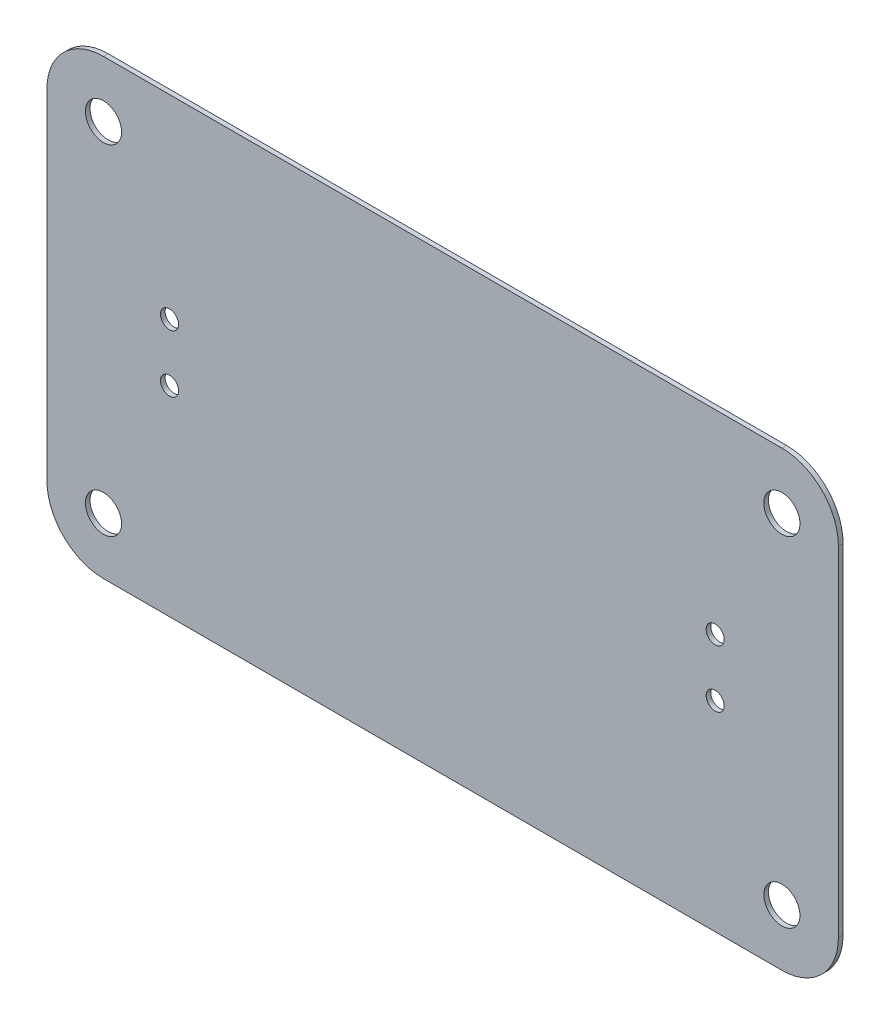
ISO-10303-21;
HEADER;
FILE_DESCRIPTION(('STEP AP214'),'2;1');
FILE_NAME('part.step','',(''),(''),'','','');
FILE_SCHEMA(('AUTOMOTIVE_DESIGN { 1 0 10303 214 1 1 1 1 }'));
ENDSEC;
DATA;
#1=APPLICATION_CONTEXT('core data for automotive mechanical design processes');
#2=APPLICATION_PROTOCOL_DEFINITION('international standard','automotive_design',2000,#1);
#3=PRODUCT_CONTEXT('',#1,'mechanical');
#4=PRODUCT('Part','Part','',(#3));
#5=PRODUCT_RELATED_PRODUCT_CATEGORY('part','',(#4));
#6=PRODUCT_DEFINITION_FORMATION('','',#4);
#7=PRODUCT_DEFINITION_CONTEXT('part definition',#1,'design');
#8=PRODUCT_DEFINITION('design','',#6,#7);
#9=PRODUCT_DEFINITION_SHAPE('','',#8);
#10=(LENGTH_UNIT() NAMED_UNIT(*) SI_UNIT(.MILLI.,.METRE.));
#11=(NAMED_UNIT(*) PLANE_ANGLE_UNIT() SI_UNIT($,.RADIAN.));
#12=(NAMED_UNIT(*) SI_UNIT($,.STERADIAN.) SOLID_ANGLE_UNIT());
#13=UNCERTAINTY_MEASURE_WITH_UNIT(LENGTH_MEASURE(1.E-05),#10,'distance_accuracy_value','');
#14=(GEOMETRIC_REPRESENTATION_CONTEXT(3) GLOBAL_UNCERTAINTY_ASSIGNED_CONTEXT((#13)) GLOBAL_UNIT_ASSIGNED_CONTEXT((#10,
#11,#12)) REPRESENTATION_CONTEXT('',''));
#15=CARTESIAN_POINT('',(0.,0.,0.));
#16=DIRECTION('',(0.,0.,1.));
#17=DIRECTION('',(1.,0.,0.));
#18=AXIS2_PLACEMENT_3D('',#15,#16,#17);
#19=CARTESIAN_POINT('',(35.386001586914,38.608001708984,0.41148));
#20=DIRECTION('',(0.,0.,1.));
#21=DIRECTION('',(1.,0.,0.));
#22=AXIS2_PLACEMENT_3D('',#19,#20,#21);
#23=PLANE('',#22);
#24=CARTESIAN_POINT('',(100.38599938,68.60800096,0.41148));
#25=DIRECTION('',(0.,0.,-1.));
#26=DIRECTION('',(-1.,0.,0.));
#27=AXIS2_PLACEMENT_3D('',#24,#25,#26);
#28=CIRCLE('',#27,1.59999934);
#29=CARTESIAN_POINT('',(98.78600004,68.60800096,0.41148));
#30=VERTEX_POINT('',#29);
#31=EDGE_CURVE('E148',#30,#30,#28,.T.);
#32=ORIENTED_EDGE('',*,*,#31,.T.);
#33=EDGE_LOOP('',(#32));
#34=FACE_BOUND('',#33,.T.);
#35=CARTESIAN_POINT('',(94.488,56.38800508,0.41148));
#36=DIRECTION('',(0.,0.,-1.));
#37=DIRECTION('',(-1.,0.,0.));
#38=AXIS2_PLACEMENT_3D('',#35,#36,#37);
#39=CIRCLE('',#38,0.7999984);
#40=CARTESIAN_POINT('',(93.6880016,56.38800508,0.41148));
#41=VERTEX_POINT('',#40);
#42=EDGE_CURVE('E151',#41,#41,#39,.T.);
#43=ORIENTED_EDGE('',*,*,#42,.T.);
#44=EDGE_LOOP('',(#43));
#45=FACE_BOUND('',#44,.T.);
#46=CARTESIAN_POINT('',(100.38599938,38.608,0.41148));
#47=DIRECTION('',(0.,0.,-1.));
#48=DIRECTION('',(-1.,0.,0.));
#49=AXIS2_PLACEMENT_3D('',#46,#47,#48);
#50=CIRCLE('',#49,1.59999934);
#51=CARTESIAN_POINT('',(98.78600004,38.608,0.41148));
#52=VERTEX_POINT('',#51);
#53=EDGE_CURVE('E154',#52,#52,#50,.T.);
#54=ORIENTED_EDGE('',*,*,#53,.T.);
#55=EDGE_LOOP('',(#54));
#56=FACE_BOUND('',#55,.T.);
#57=CARTESIAN_POINT('',(94.488,51.30799492,0.41148));
#58=DIRECTION('',(0.,0.,-1.));
#59=DIRECTION('',(-1.,0.,0.));
#60=AXIS2_PLACEMENT_3D('',#57,#58,#59);
#61=CIRCLE('',#60,0.7999984);
#62=CARTESIAN_POINT('',(93.6880016,51.30799492,0.41148));
#63=VERTEX_POINT('',#62);
#64=EDGE_CURVE('E157',#63,#63,#61,.T.);
#65=ORIENTED_EDGE('',*,*,#64,.T.);
#66=EDGE_LOOP('',(#65));
#67=FACE_BOUND('',#66,.T.);
#68=CARTESIAN_POINT('',(46.228,56.388,0.41148));
#69=DIRECTION('',(0.,0.,-1.));
#70=DIRECTION('',(-1.,0.,0.));
#71=AXIS2_PLACEMENT_3D('',#68,#69,#70);
#72=CIRCLE('',#71,0.7999984);
#73=CARTESIAN_POINT('',(45.4280016,56.388,0.41148));
#74=VERTEX_POINT('',#73);
#75=EDGE_CURVE('E160',#74,#74,#72,.T.);
#76=ORIENTED_EDGE('',*,*,#75,.T.);
#77=EDGE_LOOP('',(#76));
#78=FACE_BOUND('',#77,.T.);
#79=CARTESIAN_POINT('',(40.38599746,68.60800096,0.41148));
#80=DIRECTION('',(0.,0.,-1.));
#81=DIRECTION('',(-1.,0.,0.));
#82=AXIS2_PLACEMENT_3D('',#79,#80,#81);
#83=CIRCLE('',#82,1.59999934);
#84=CARTESIAN_POINT('',(38.78599812,68.60800096,0.41148));
#85=VERTEX_POINT('',#84);
#86=EDGE_CURVE('E163',#85,#85,#83,.T.);
#87=ORIENTED_EDGE('',*,*,#86,.T.);
#88=EDGE_LOOP('',(#87));
#89=FACE_BOUND('',#88,.T.);
#90=CARTESIAN_POINT('',(46.228,51.308,0.41148));
#91=DIRECTION('',(0.,0.,-1.));
#92=DIRECTION('',(-1.,0.,0.));
#93=AXIS2_PLACEMENT_3D('',#90,#91,#92);
#94=CIRCLE('',#93,0.7999984);
#95=CARTESIAN_POINT('',(45.4280016,51.308,0.41148));
#96=VERTEX_POINT('',#95);
#97=EDGE_CURVE('E166',#96,#96,#94,.T.);
#98=ORIENTED_EDGE('',*,*,#97,.T.);
#99=EDGE_LOOP('',(#98));
#100=FACE_BOUND('',#99,.T.);
#101=CARTESIAN_POINT('',(40.386,38.608,0.41148));
#102=DIRECTION('',(0.,0.,-1.));
#103=DIRECTION('',(-1.,0.,0.));
#104=AXIS2_PLACEMENT_3D('',#101,#102,#103);
#105=CIRCLE('',#104,1.59999934);
#106=CARTESIAN_POINT('',(38.78600066,38.608,0.41148));
#107=VERTEX_POINT('',#106);
#108=EDGE_CURVE('E169',#107,#107,#105,.T.);
#109=ORIENTED_EDGE('',*,*,#108,.T.);
#110=EDGE_LOOP('',(#109));
#111=FACE_BOUND('',#110,.T.);
#112=CARTESIAN_POINT('',(40.384413247929,68.60959004797,0.41148));
#113=DIRECTION('',(0.,0.,-1.));
#114=DIRECTION('',(-1.,0.,0.));
#115=AXIS2_PLACEMENT_3D('',#112,#113,#114);
#116=CIRCLE('',#115,4.998411913377);
#117=CARTESIAN_POINT('',(35.386001586914,68.608001708984,0.41148));
#118=VERTEX_POINT('',#117);
#119=CARTESIAN_POINT('',(40.386001586914,73.6080017089846,0.41148));
#120=VERTEX_POINT('',#119);
#121=EDGE_CURVE('E172',#118,#120,#116,.T.);
#122=ORIENTED_EDGE('',*,*,#121,.F.);
#123=DIRECTION('',(0.,1.,0.));
#124=VECTOR('',#123,1.);
#125=CARTESIAN_POINT('',(35.386001586914,38.608001708984,0.41148));
#126=LINE('',#125,#124);
#127=CARTESIAN_POINT('',(35.3860015869142,38.608001708984,0.41148));
#128=VERTEX_POINT('',#127);
#129=EDGE_CURVE('E93',#128,#118,#126,.T.);
#130=ORIENTED_EDGE('',*,*,#129,.F.);
#131=CARTESIAN_POINT('',(40.384400233771,38.606400355841,0.41148));
#132=DIRECTION('',(0.,0.,-1.));
#133=DIRECTION('',(-1.,0.,0.));
#134=AXIS2_PLACEMENT_3D('',#131,#132,#133);
#135=CIRCLE('',#134,4.998398903372);
#136=CARTESIAN_POINT('',(40.386001586914,33.608001708984,0.41148));
#137=VERTEX_POINT('',#136);
#138=EDGE_CURVE('E20',#137,#128,#135,.T.);
#139=ORIENTED_EDGE('',*,*,#138,.F.);
#140=DIRECTION('',(1.,0.,0.));
#141=VECTOR('',#140,1.);
#142=CARTESIAN_POINT('',(100.38600158691,33.608001708984,0.41148));
#143=LINE('',#142,#141);
#144=CARTESIAN_POINT('',(100.38600158691,33.6080017089842,0.41148));
#145=VERTEX_POINT('',#144);
#146=EDGE_CURVE('E79',#145,#137,#143,.F.);
#147=ORIENTED_EDGE('',*,*,#146,.F.);
#148=CARTESIAN_POINT('',(100.38758992589,38.606413369999,0.41148));
#149=DIRECTION('',(0.,0.,-1.));
#150=DIRECTION('',(-1.,0.,0.));
#151=AXIS2_PLACEMENT_3D('',#148,#149,#150);
#152=CIRCLE('',#151,4.998411913377);
#153=CARTESIAN_POINT('',(105.38600158691,38.608001708984,0.41148));
#154=VERTEX_POINT('',#153);
#155=EDGE_CURVE('E100',#154,#145,#152,.T.);
#156=ORIENTED_EDGE('',*,*,#155,.F.);
#157=DIRECTION('',(0.,1.,0.));
#158=VECTOR('',#157,1.);
#159=CARTESIAN_POINT('',(105.38600158691,68.608001708984,0.41148));
#160=LINE('',#159,#158);
#161=CARTESIAN_POINT('',(105.386001586909,68.608001708984,0.41148));
#162=VERTEX_POINT('',#161);
#163=EDGE_CURVE('E111',#162,#154,#160,.F.);
#164=ORIENTED_EDGE('',*,*,#163,.F.);
#165=CARTESIAN_POINT('',(100.38757691164,68.609577033716,0.41148));
#166=DIRECTION('',(0.,0.,-1.));
#167=DIRECTION('',(-1.,0.,0.));
#168=AXIS2_PLACEMENT_3D('',#165,#166,#167);
#169=CIRCLE('',#168,4.998424923511);
#170=CARTESIAN_POINT('',(100.38600158691,73.608001708984,0.41148));
#171=VERTEX_POINT('',#170);
#172=EDGE_CURVE('E175',#171,#162,#169,.T.);
#173=ORIENTED_EDGE('',*,*,#172,.F.);
#174=DIRECTION('',(1.,0.,0.));
#175=VECTOR('',#174,1.);
#176=CARTESIAN_POINT('',(40.386001586914,73.608001708984,0.41148));
#177=LINE('',#176,#175);
#178=EDGE_CURVE('E107',#120,#171,#177,.T.);
#179=ORIENTED_EDGE('',*,*,#178,.F.);
#180=EDGE_LOOP('',(#122,#130,#139,#147,#156,#164,#173,#179));
#181=FACE_BOUND('',#180,.T.);
#182=ADVANCED_FACE('F17',(#34,#45,#56,#67,#78,#89,#100,#111,#181),#23,.T.);
#183=CARTESIAN_POINT('',(40.384400233771,38.606400355841,0.));
#184=DIRECTION('',(0.,0.,-1.));
#185=DIRECTION('',(-1.,0.,0.));
#186=AXIS2_PLACEMENT_3D('',#183,#184,#185);
#187=CYLINDRICAL_SURFACE('',#186,4.998398903372);
#188=DIRECTION('',(0.,0.,1.));
#189=VECTOR('',#188,1.);
#190=CARTESIAN_POINT('',(35.386001586914,38.608001708984,0.));
#191=LINE('',#190,#189);
#192=CARTESIAN_POINT('',(35.3860015869142,38.608001708984,0.));
#193=VERTEX_POINT('',#192);
#194=EDGE_CURVE('E106',#193,#128,#191,.T.);
#195=ORIENTED_EDGE('',*,*,#194,.F.);
#196=CARTESIAN_POINT('',(40.384400233771,38.606400355841,0.));
#197=DIRECTION('',(0.,0.,-1.));
#198=DIRECTION('',(-1.,0.,0.));
#199=AXIS2_PLACEMENT_3D('',#196,#197,#198);
#200=CIRCLE('',#199,4.998398903372);
#201=CARTESIAN_POINT('',(40.386001586914,33.608001708984,0.));
#202=VERTEX_POINT('',#201);
#203=EDGE_CURVE('E99',#193,#202,#200,.F.);
#204=ORIENTED_EDGE('',*,*,#203,.T.);
#205=DIRECTION('',(0.,0.,-1.));
#206=VECTOR('',#205,1.);
#207=CARTESIAN_POINT('',(40.386001586914,33.608001708984,0.));
#208=LINE('',#207,#206);
#209=EDGE_CURVE('E84',#137,#202,#208,.T.);
#210=ORIENTED_EDGE('',*,*,#209,.F.);
#211=ORIENTED_EDGE('',*,*,#138,.T.);
#212=EDGE_LOOP('',(#195,#204,#210,#211));
#213=FACE_BOUND('',#212,.T.);
#214=ADVANCED_FACE('F98',(#213),#187,.T.);
#215=CARTESIAN_POINT('',(100.38600158691,33.608001708984,0.));
#216=DIRECTION('',(0.,-1.,0.));
#217=DIRECTION('',(0.,0.,-1.));
#218=AXIS2_PLACEMENT_3D('',#215,#216,#217);
#219=PLANE('',#218);
#220=ORIENTED_EDGE('',*,*,#209,.T.);
#221=DIRECTION('',(1.,0.,0.));
#222=VECTOR('',#221,1.);
#223=CARTESIAN_POINT('',(35.386001586914,33.608001708984,0.));
#224=LINE('',#223,#222);
#225=CARTESIAN_POINT('',(100.38600158691,33.6080017089842,0.));
#226=VERTEX_POINT('',#225);
#227=EDGE_CURVE('E146',#202,#226,#224,.T.);
#228=ORIENTED_EDGE('',*,*,#227,.T.);
#229=DIRECTION('',(0.,0.,-1.));
#230=VECTOR('',#229,1.);
#231=CARTESIAN_POINT('',(100.38600158691,33.6080017089842,0.));
#232=LINE('',#231,#230);
#233=EDGE_CURVE('E86',#145,#226,#232,.T.);
#234=ORIENTED_EDGE('',*,*,#233,.F.);
#235=ORIENTED_EDGE('',*,*,#146,.T.);
#236=EDGE_LOOP('',(#220,#228,#234,#235));
#237=FACE_BOUND('',#236,.T.);
#238=ADVANCED_FACE('F81',(#237),#219,.T.);
#239=CARTESIAN_POINT('',(100.38758992589,38.606413369999,0.));
#240=DIRECTION('',(0.,0.,-1.));
#241=DIRECTION('',(-1.,0.,0.));
#242=AXIS2_PLACEMENT_3D('',#239,#240,#241);
#243=CYLINDRICAL_SURFACE('',#242,4.998411913377);
#244=ORIENTED_EDGE('',*,*,#233,.T.);
#245=CARTESIAN_POINT('',(100.38758992589,38.606413369999,0.));
#246=DIRECTION('',(0.,0.,-1.));
#247=DIRECTION('',(-1.,0.,0.));
#248=AXIS2_PLACEMENT_3D('',#245,#246,#247);
#249=CIRCLE('',#248,4.998411913377);
#250=CARTESIAN_POINT('',(105.38600158691,38.608001708984,0.));
#251=VERTEX_POINT('',#250);
#252=EDGE_CURVE('E143',#226,#251,#249,.F.);
#253=ORIENTED_EDGE('',*,*,#252,.T.);
#254=DIRECTION('',(0.,0.,-1.));
#255=VECTOR('',#254,1.);
#256=CARTESIAN_POINT('',(105.38600158691,38.608001708984,0.));
#257=LINE('',#256,#255);
#258=EDGE_CURVE('E112',#154,#251,#257,.T.);
#259=ORIENTED_EDGE('',*,*,#258,.F.);
#260=ORIENTED_EDGE('',*,*,#155,.T.);
#261=EDGE_LOOP('',(#244,#253,#259,#260));
#262=FACE_BOUND('',#261,.T.);
#263=ADVANCED_FACE('F211',(#262),#243,.T.);
#264=CARTESIAN_POINT('',(105.38600158691,68.608001708984,0.));
#265=DIRECTION('',(1.,0.,0.));
#266=DIRECTION('',(0.,0.,-1.));
#267=AXIS2_PLACEMENT_3D('',#264,#265,#266);
#268=PLANE('',#267);
#269=ORIENTED_EDGE('',*,*,#258,.T.);
#270=DIRECTION('',(0.,1.,0.));
#271=VECTOR('',#270,1.);
#272=CARTESIAN_POINT('',(105.38600158691,38.608001708984,0.));
#273=LINE('',#272,#271);
#274=CARTESIAN_POINT('',(105.386001586909,68.608001708984,0.));
#275=VERTEX_POINT('',#274);
#276=EDGE_CURVE('E142',#251,#275,#273,.T.);
#277=ORIENTED_EDGE('',*,*,#276,.T.);
#278=DIRECTION('',(0.,0.,-1.));
#279=VECTOR('',#278,1.);
#280=CARTESIAN_POINT('',(105.386001586908,68.608001708984,0.));
#281=LINE('',#280,#279);
#282=EDGE_CURVE('E110',#162,#275,#281,.T.);
#283=ORIENTED_EDGE('',*,*,#282,.F.);
#284=ORIENTED_EDGE('',*,*,#163,.T.);
#285=EDGE_LOOP('',(#269,#277,#283,#284));
#286=FACE_BOUND('',#285,.T.);
#287=ADVANCED_FACE('F208',(#286),#268,.T.);
#288=CARTESIAN_POINT('',(100.38757691164,68.609577033716,0.));
#289=DIRECTION('',(0.,0.,-1.));
#290=DIRECTION('',(-1.,0.,0.));
#291=AXIS2_PLACEMENT_3D('',#288,#289,#290);
#292=CYLINDRICAL_SURFACE('',#291,4.998424923511);
#293=ORIENTED_EDGE('',*,*,#282,.T.);
#294=CARTESIAN_POINT('',(100.38757691164,68.609577033716,0.));
#295=DIRECTION('',(0.,0.,-1.));
#296=DIRECTION('',(-1.,0.,0.));
#297=AXIS2_PLACEMENT_3D('',#294,#295,#296);
#298=CIRCLE('',#297,4.998424923511);
#299=CARTESIAN_POINT('',(100.38600158691,73.608001708984,0.));
#300=VERTEX_POINT('',#299);
#301=EDGE_CURVE('E139',#275,#300,#298,.F.);
#302=ORIENTED_EDGE('',*,*,#301,.T.);
#303=DIRECTION('',(0.,0.,1.));
#304=VECTOR('',#303,1.);
#305=CARTESIAN_POINT('',(100.38600158691,73.608001708984,0.));
#306=LINE('',#305,#304);
#307=EDGE_CURVE('E109',#171,#300,#306,.F.);
#308=ORIENTED_EDGE('',*,*,#307,.F.);
#309=ORIENTED_EDGE('',*,*,#172,.T.);
#310=EDGE_LOOP('',(#293,#302,#308,#309));
#311=FACE_BOUND('',#310,.T.);
#312=ADVANCED_FACE('F206',(#311),#292,.T.);
#313=CARTESIAN_POINT('',(40.386001586914,73.608001708984,0.));
#314=DIRECTION('',(0.,1.,0.));
#315=DIRECTION('',(0.,0.,1.));
#316=AXIS2_PLACEMENT_3D('',#313,#314,#315);
#317=PLANE('',#316);
#318=ORIENTED_EDGE('',*,*,#307,.T.);
#319=DIRECTION('',(1.,0.,0.));
#320=VECTOR('',#319,1.);
#321=CARTESIAN_POINT('',(35.386001586914,73.608001708984,0.));
#322=LINE('',#321,#320);
#323=CARTESIAN_POINT('',(40.386001586914,73.6080017089846,0.));
#324=VERTEX_POINT('',#323);
#325=EDGE_CURVE('E138',#300,#324,#322,.F.);
#326=ORIENTED_EDGE('',*,*,#325,.T.);
#327=DIRECTION('',(0.,0.,-1.));
#328=VECTOR('',#327,1.);
#329=CARTESIAN_POINT('',(40.386001586914,73.6080017089848,0.));
#330=LINE('',#329,#328);
#331=EDGE_CURVE('E174',#120,#324,#330,.T.);
#332=ORIENTED_EDGE('',*,*,#331,.F.);
#333=ORIENTED_EDGE('',*,*,#178,.T.);
#334=EDGE_LOOP('',(#318,#326,#332,#333));
#335=FACE_BOUND('',#334,.T.);
#336=ADVANCED_FACE('F204',(#335),#317,.T.);
#337=CARTESIAN_POINT('',(40.384413247929,68.60959004797,0.));
#338=DIRECTION('',(0.,0.,-1.));
#339=DIRECTION('',(-1.,0.,0.));
#340=AXIS2_PLACEMENT_3D('',#337,#338,#339);
#341=CYLINDRICAL_SURFACE('',#340,4.998411913377);
#342=ORIENTED_EDGE('',*,*,#331,.T.);
#343=CARTESIAN_POINT('',(40.384413247929,68.60959004797,0.));
#344=DIRECTION('',(0.,0.,-1.));
#345=DIRECTION('',(-1.,0.,0.));
#346=AXIS2_PLACEMENT_3D('',#343,#344,#345);
#347=CIRCLE('',#346,4.998411913377);
#348=CARTESIAN_POINT('',(35.386001586914,68.608001708984,0.));
#349=VERTEX_POINT('',#348);
#350=EDGE_CURVE('E135',#324,#349,#347,.F.);
#351=ORIENTED_EDGE('',*,*,#350,.T.);
#352=DIRECTION('',(0.,0.,1.));
#353=VECTOR('',#352,1.);
#354=CARTESIAN_POINT('',(35.386001586914,68.608001708984,0.));
#355=LINE('',#354,#353);
#356=EDGE_CURVE('E35',#118,#349,#355,.F.);
#357=ORIENTED_EDGE('',*,*,#356,.F.);
#358=ORIENTED_EDGE('',*,*,#121,.T.);
#359=EDGE_LOOP('',(#342,#351,#357,#358));
#360=FACE_BOUND('',#359,.T.);
#361=ADVANCED_FACE('F200',(#360),#341,.T.);
#362=CARTESIAN_POINT('',(35.386001586914,38.608001708984,0.));
#363=DIRECTION('',(-1.,0.,0.));
#364=DIRECTION('',(0.,0.,1.));
#365=AXIS2_PLACEMENT_3D('',#362,#363,#364);
#366=PLANE('',#365);
#367=ORIENTED_EDGE('',*,*,#356,.T.);
#368=DIRECTION('',(0.,1.,0.));
#369=VECTOR('',#368,1.);
#370=CARTESIAN_POINT('',(35.386001586914,38.608001708984,0.));
#371=LINE('',#370,#369);
#372=EDGE_CURVE('E134',#349,#193,#371,.F.);
#373=ORIENTED_EDGE('',*,*,#372,.T.);
#374=ORIENTED_EDGE('',*,*,#194,.T.);
#375=ORIENTED_EDGE('',*,*,#129,.T.);
#376=EDGE_LOOP('',(#367,#373,#374,#375));
#377=FACE_BOUND('',#376,.T.);
#378=ADVANCED_FACE('F194',(#377),#366,.T.);
#379=CARTESIAN_POINT('',(40.386,38.608,0.));
#380=DIRECTION('',(0.,0.,-1.));
#381=DIRECTION('',(-1.,0.,0.));
#382=AXIS2_PLACEMENT_3D('',#379,#380,#381);
#383=CYLINDRICAL_SURFACE('',#382,1.59999934);
#384=ORIENTED_EDGE('',*,*,#108,.F.);
#385=EDGE_LOOP('',(#384));
#386=FACE_BOUND('',#385,.T.);
#387=CARTESIAN_POINT('',(40.386,38.608,0.));
#388=DIRECTION('',(0.,0.,-1.));
#389=DIRECTION('',(-1.,0.,0.));
#390=AXIS2_PLACEMENT_3D('',#387,#388,#389);
#391=CIRCLE('',#390,1.59999934);
#392=CARTESIAN_POINT('',(38.78600066,38.608,0.));
#393=VERTEX_POINT('',#392);
#394=EDGE_CURVE('E131',#393,#393,#391,.T.);
#395=ORIENTED_EDGE('',*,*,#394,.T.);
#396=EDGE_LOOP('',(#395));
#397=FACE_BOUND('',#396,.T.);
#398=ADVANCED_FACE('F256',(#386,#397),#383,.F.);
#399=CARTESIAN_POINT('',(46.228,51.308,0.));
#400=DIRECTION('',(0.,0.,-1.));
#401=DIRECTION('',(-1.,0.,0.));
#402=AXIS2_PLACEMENT_3D('',#399,#400,#401);
#403=CYLINDRICAL_SURFACE('',#402,0.7999984);
#404=ORIENTED_EDGE('',*,*,#97,.F.);
#405=EDGE_LOOP('',(#404));
#406=FACE_BOUND('',#405,.T.);
#407=CARTESIAN_POINT('',(46.228,51.308,0.));
#408=DIRECTION('',(0.,0.,-1.));
#409=DIRECTION('',(-1.,0.,0.));
#410=AXIS2_PLACEMENT_3D('',#407,#408,#409);
#411=CIRCLE('',#410,0.7999984);
#412=CARTESIAN_POINT('',(45.4280016,51.308,0.));
#413=VERTEX_POINT('',#412);
#414=EDGE_CURVE('E128',#413,#413,#411,.T.);
#415=ORIENTED_EDGE('',*,*,#414,.T.);
#416=EDGE_LOOP('',(#415));
#417=FACE_BOUND('',#416,.T.);
#418=ADVANCED_FACE('F252',(#406,#417),#403,.F.);
#419=CARTESIAN_POINT('',(40.38599746,68.60800096,0.));
#420=DIRECTION('',(0.,0.,-1.));
#421=DIRECTION('',(-1.,0.,0.));
#422=AXIS2_PLACEMENT_3D('',#419,#420,#421);
#423=CYLINDRICAL_SURFACE('',#422,1.59999934);
#424=ORIENTED_EDGE('',*,*,#86,.F.);
#425=EDGE_LOOP('',(#424));
#426=FACE_BOUND('',#425,.T.);
#427=CARTESIAN_POINT('',(40.38599746,68.60800096,0.));
#428=DIRECTION('',(0.,0.,-1.));
#429=DIRECTION('',(-1.,0.,0.));
#430=AXIS2_PLACEMENT_3D('',#427,#428,#429);
#431=CIRCLE('',#430,1.59999934);
#432=CARTESIAN_POINT('',(38.78599812,68.60800096,0.));
#433=VERTEX_POINT('',#432);
#434=EDGE_CURVE('E125',#433,#433,#431,.T.);
#435=ORIENTED_EDGE('',*,*,#434,.T.);
#436=EDGE_LOOP('',(#435));
#437=FACE_BOUND('',#436,.T.);
#438=ADVANCED_FACE('F248',(#426,#437),#423,.F.);
#439=CARTESIAN_POINT('',(46.228,56.388,0.));
#440=DIRECTION('',(0.,0.,-1.));
#441=DIRECTION('',(-1.,0.,0.));
#442=AXIS2_PLACEMENT_3D('',#439,#440,#441);
#443=CYLINDRICAL_SURFACE('',#442,0.7999984);
#444=ORIENTED_EDGE('',*,*,#75,.F.);
#445=EDGE_LOOP('',(#444));
#446=FACE_BOUND('',#445,.T.);
#447=CARTESIAN_POINT('',(46.228,56.388,0.));
#448=DIRECTION('',(0.,0.,-1.));
#449=DIRECTION('',(-1.,0.,0.));
#450=AXIS2_PLACEMENT_3D('',#447,#448,#449);
#451=CIRCLE('',#450,0.7999984);
#452=CARTESIAN_POINT('',(45.4280016,56.388,0.));
#453=VERTEX_POINT('',#452);
#454=EDGE_CURVE('E122',#453,#453,#451,.T.);
#455=ORIENTED_EDGE('',*,*,#454,.T.);
#456=EDGE_LOOP('',(#455));
#457=FACE_BOUND('',#456,.T.);
#458=ADVANCED_FACE('F244',(#446,#457),#443,.F.);
#459=CARTESIAN_POINT('',(94.488,51.30799492,0.));
#460=DIRECTION('',(0.,0.,-1.));
#461=DIRECTION('',(-1.,0.,0.));
#462=AXIS2_PLACEMENT_3D('',#459,#460,#461);
#463=CYLINDRICAL_SURFACE('',#462,0.7999984);
#464=ORIENTED_EDGE('',*,*,#64,.F.);
#465=EDGE_LOOP('',(#464));
#466=FACE_BOUND('',#465,.T.);
#467=CARTESIAN_POINT('',(94.488,51.30799492,0.));
#468=DIRECTION('',(0.,0.,-1.));
#469=DIRECTION('',(-1.,0.,0.));
#470=AXIS2_PLACEMENT_3D('',#467,#468,#469);
#471=CIRCLE('',#470,0.7999984);
#472=CARTESIAN_POINT('',(93.6880016,51.30799492,0.));
#473=VERTEX_POINT('',#472);
#474=EDGE_CURVE('E119',#473,#473,#471,.T.);
#475=ORIENTED_EDGE('',*,*,#474,.T.);
#476=EDGE_LOOP('',(#475));
#477=FACE_BOUND('',#476,.T.);
#478=ADVANCED_FACE('F240',(#466,#477),#463,.F.);
#479=CARTESIAN_POINT('',(100.38599938,38.608,0.));
#480=DIRECTION('',(0.,0.,-1.));
#481=DIRECTION('',(-1.,0.,0.));
#482=AXIS2_PLACEMENT_3D('',#479,#480,#481);
#483=CYLINDRICAL_SURFACE('',#482,1.59999934);
#484=ORIENTED_EDGE('',*,*,#53,.F.);
#485=EDGE_LOOP('',(#484));
#486=FACE_BOUND('',#485,.T.);
#487=CARTESIAN_POINT('',(100.38599938,38.608,0.));
#488=DIRECTION('',(0.,0.,-1.));
#489=DIRECTION('',(-1.,0.,0.));
#490=AXIS2_PLACEMENT_3D('',#487,#488,#489);
#491=CIRCLE('',#490,1.59999934);
#492=CARTESIAN_POINT('',(98.78600004,38.608,0.));
#493=VERTEX_POINT('',#492);
#494=EDGE_CURVE('E116',#493,#493,#491,.T.);
#495=ORIENTED_EDGE('',*,*,#494,.T.);
#496=EDGE_LOOP('',(#495));
#497=FACE_BOUND('',#496,.T.);
#498=ADVANCED_FACE('F236',(#486,#497),#483,.F.);
#499=CARTESIAN_POINT('',(94.488,56.38800508,0.));
#500=DIRECTION('',(0.,0.,-1.));
#501=DIRECTION('',(-1.,0.,0.));
#502=AXIS2_PLACEMENT_3D('',#499,#500,#501);
#503=CYLINDRICAL_SURFACE('',#502,0.7999984);
#504=ORIENTED_EDGE('',*,*,#42,.F.);
#505=EDGE_LOOP('',(#504));
#506=FACE_BOUND('',#505,.T.);
#507=CARTESIAN_POINT('',(94.488,56.38800508,0.));
#508=DIRECTION('',(0.,0.,-1.));
#509=DIRECTION('',(-1.,0.,0.));
#510=AXIS2_PLACEMENT_3D('',#507,#508,#509);
#511=CIRCLE('',#510,0.7999984);
#512=CARTESIAN_POINT('',(93.6880016,56.38800508,0.));
#513=VERTEX_POINT('',#512);
#514=EDGE_CURVE('E26',#513,#513,#511,.T.);
#515=ORIENTED_EDGE('',*,*,#514,.T.);
#516=EDGE_LOOP('',(#515));
#517=FACE_BOUND('',#516,.T.);
#518=ADVANCED_FACE('F228',(#506,#517),#503,.F.);
#519=CARTESIAN_POINT('',(100.38599938,68.60800096,0.));
#520=DIRECTION('',(0.,0.,-1.));
#521=DIRECTION('',(-1.,0.,0.));
#522=AXIS2_PLACEMENT_3D('',#519,#520,#521);
#523=CYLINDRICAL_SURFACE('',#522,1.59999934);
#524=ORIENTED_EDGE('',*,*,#31,.F.);
#525=EDGE_LOOP('',(#524));
#526=FACE_BOUND('',#525,.T.);
#527=CARTESIAN_POINT('',(100.38599938,68.60800096,0.));
#528=DIRECTION('',(0.,0.,-1.));
#529=DIRECTION('',(-1.,0.,0.));
#530=AXIS2_PLACEMENT_3D('',#527,#528,#529);
#531=CIRCLE('',#530,1.59999934);
#532=CARTESIAN_POINT('',(98.78600004,68.60800096,0.));
#533=VERTEX_POINT('',#532);
#534=EDGE_CURVE('E11',#533,#533,#531,.T.);
#535=ORIENTED_EDGE('',*,*,#534,.T.);
#536=EDGE_LOOP('',(#535));
#537=FACE_BOUND('',#536,.T.);
#538=ADVANCED_FACE('F222',(#526,#537),#523,.F.);
#539=CARTESIAN_POINT('',(35.386001586914,38.608001708984,0.));
#540=DIRECTION('',(0.,0.,1.));
#541=DIRECTION('',(1.,0.,0.));
#542=AXIS2_PLACEMENT_3D('',#539,#540,#541);
#543=PLANE('',#542);
#544=ORIENTED_EDGE('',*,*,#534,.F.);
#545=EDGE_LOOP('',(#544));
#546=FACE_BOUND('',#545,.T.);
#547=ORIENTED_EDGE('',*,*,#514,.F.);
#548=EDGE_LOOP('',(#547));
#549=FACE_BOUND('',#548,.T.);
#550=ORIENTED_EDGE('',*,*,#494,.F.);
#551=EDGE_LOOP('',(#550));
#552=FACE_BOUND('',#551,.T.);
#553=ORIENTED_EDGE('',*,*,#474,.F.);
#554=EDGE_LOOP('',(#553));
#555=FACE_BOUND('',#554,.T.);
#556=ORIENTED_EDGE('',*,*,#454,.F.);
#557=EDGE_LOOP('',(#556));
#558=FACE_BOUND('',#557,.T.);
#559=ORIENTED_EDGE('',*,*,#434,.F.);
#560=EDGE_LOOP('',(#559));
#561=FACE_BOUND('',#560,.T.);
#562=ORIENTED_EDGE('',*,*,#414,.F.);
#563=EDGE_LOOP('',(#562));
#564=FACE_BOUND('',#563,.T.);
#565=ORIENTED_EDGE('',*,*,#394,.F.);
#566=EDGE_LOOP('',(#565));
#567=FACE_BOUND('',#566,.T.);
#568=ORIENTED_EDGE('',*,*,#350,.F.);
#569=ORIENTED_EDGE('',*,*,#325,.F.);
#570=ORIENTED_EDGE('',*,*,#301,.F.);
#571=ORIENTED_EDGE('',*,*,#276,.F.);
#572=ORIENTED_EDGE('',*,*,#252,.F.);
#573=ORIENTED_EDGE('',*,*,#227,.F.);
#574=ORIENTED_EDGE('',*,*,#203,.F.);
#575=ORIENTED_EDGE('',*,*,#372,.F.);
#576=EDGE_LOOP('',(#568,#569,#570,#571,#572,#573,#574,#575));
#577=FACE_BOUND('',#576,.T.);
#578=ADVANCED_FACE('F197',(#546,#549,#552,#555,#558,#561,#564,#567,#577),#543,.F.);
#579=CLOSED_SHELL('',(#182,#214,#238,#263,#287,#312,#336,#361,#378,#398,#418,#438,#458,#478,
#498,#518,#538,#578));
#580=MANIFOLD_SOLID_BREP('B1',#579);
#581=ADVANCED_BREP_SHAPE_REPRESENTATION('',(#18,#580),#14);
#582=SHAPE_DEFINITION_REPRESENTATION(#9,#581);
ENDSEC;
END-ISO-10303-21;
